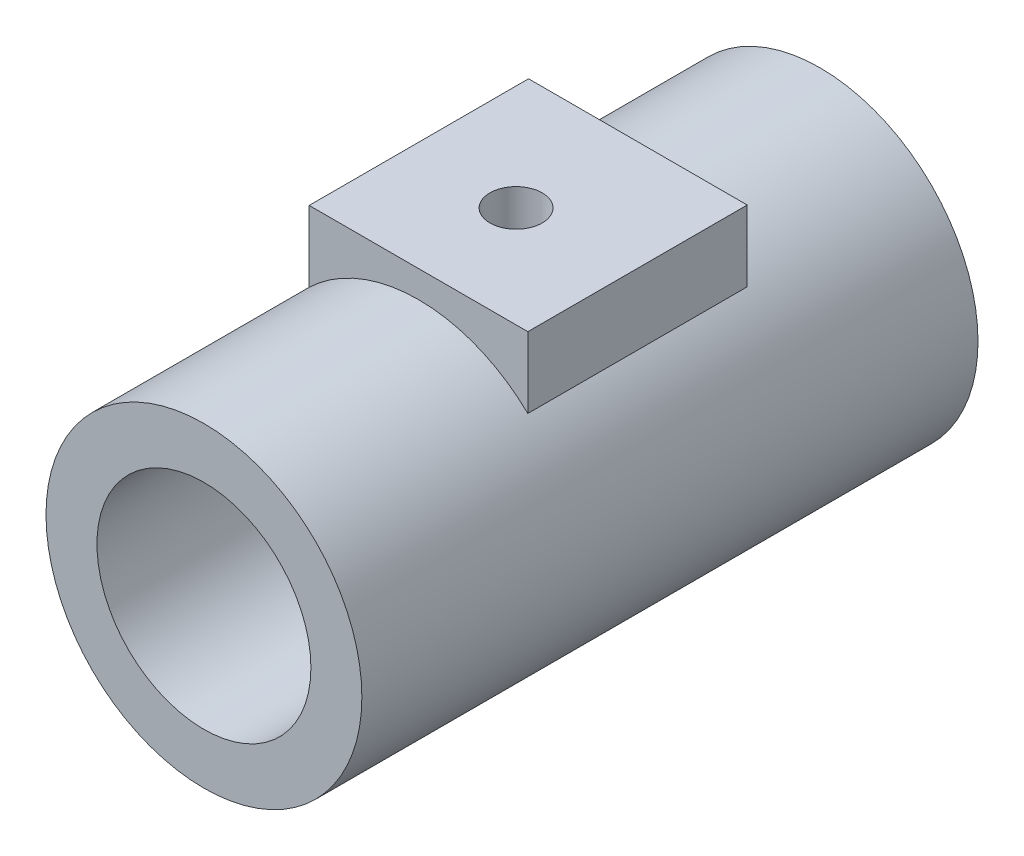
ISO-10303-21;
HEADER;
FILE_DESCRIPTION(('STEP AP214'),'2;1');
FILE_NAME('part.step','',(''),(''),'','','');
FILE_SCHEMA(('AUTOMOTIVE_DESIGN { 1 0 10303 214 1 1 1 1 }'));
ENDSEC;
DATA;
#1=APPLICATION_CONTEXT('core data for automotive mechanical design processes');
#2=APPLICATION_PROTOCOL_DEFINITION('international standard','automotive_design',2000,#1);
#3=PRODUCT_CONTEXT('',#1,'mechanical');
#4=PRODUCT('Part','Part','',(#3));
#5=PRODUCT_RELATED_PRODUCT_CATEGORY('part','',(#4));
#6=PRODUCT_DEFINITION_FORMATION('','',#4);
#7=PRODUCT_DEFINITION_CONTEXT('part definition',#1,'design');
#8=PRODUCT_DEFINITION('design','',#6,#7);
#9=PRODUCT_DEFINITION_SHAPE('','',#8);
#10=(LENGTH_UNIT() NAMED_UNIT(*) SI_UNIT(.MILLI.,.METRE.));
#11=(NAMED_UNIT(*) PLANE_ANGLE_UNIT() SI_UNIT($,.RADIAN.));
#12=(NAMED_UNIT(*) SI_UNIT($,.STERADIAN.) SOLID_ANGLE_UNIT());
#13=UNCERTAINTY_MEASURE_WITH_UNIT(LENGTH_MEASURE(1.E-05),#10,'distance_accuracy_value','');
#14=(GEOMETRIC_REPRESENTATION_CONTEXT(3) GLOBAL_UNCERTAINTY_ASSIGNED_CONTEXT((#13)) GLOBAL_UNIT_ASSIGNED_CONTEXT((#10,
#11,#12)) REPRESENTATION_CONTEXT('',''));
#15=CARTESIAN_POINT('',(0.,0.,0.));
#16=DIRECTION('',(0.,0.,1.));
#17=DIRECTION('',(1.,0.,0.));
#18=AXIS2_PLACEMENT_3D('',#15,#16,#17);
#19=CARTESIAN_POINT('',(0.,45.,71.0551160971746));
#20=DIRECTION('',(0.,-1.,0.));
#21=DIRECTION('',(0.,0.,-1.));
#22=AXIS2_PLACEMENT_3D('',#19,#20,#21);
#23=CYLINDRICAL_SURFACE('',#22,22.4882747443512);
#24=CARTESIAN_POINT('',(0.,-0.99999999999999,71.0551160971746));
#25=DIRECTION('',(0.,1.,0.));
#26=DIRECTION('',(0.,0.,1.));
#27=AXIS2_PLACEMENT_3D('',#24,#25,#26);
#28=CIRCLE('',#27,22.4882747443512);
#29=CARTESIAN_POINT('',(0.,-0.99999999999999,93.5433908415259));
#30=VERTEX_POINT('',#29);
#31=EDGE_CURVE('E112',#30,#30,#28,.T.);
#32=ORIENTED_EDGE('',*,*,#31,.F.);
#33=EDGE_LOOP('',(#32));
#34=FACE_BOUND('',#33,.T.);
#35=CARTESIAN_POINT('',(0.,0.,71.0551160971746));
#36=DIRECTION('',(0.,1.,0.));
#37=DIRECTION('',(0.,0.,1.));
#38=AXIS2_PLACEMENT_3D('',#35,#36,#37);
#39=CIRCLE('',#38,22.4882747443512);
#40=CARTESIAN_POINT('',(0.,0.,93.5433908415259));
#41=VERTEX_POINT('',#40);
#42=EDGE_CURVE('E183',#41,#41,#39,.T.);
#43=ORIENTED_EDGE('',*,*,#42,.T.);
#44=EDGE_LOOP('',(#43));
#45=FACE_BOUND('',#44,.T.);
#46=ADVANCED_FACE('F45',(#34,#45),#23,.F.);
#47=CARTESIAN_POINT('',(0.,0.,0.));
#48=DIRECTION('',(0.,0.,1.));
#49=DIRECTION('',(1.,0.,0.));
#50=AXIS2_PLACEMENT_3D('',#47,#48,#49);
#51=CYLINDRICAL_SURFACE('',#50,26.0462539697621);
#52=CARTESIAN_POINT('',(0.,0.,0.));
#53=DIRECTION('',(0.,0.,1.));
#54=DIRECTION('',(1.,0.,0.));
#55=AXIS2_PLACEMENT_3D('',#52,#53,#54);
#56=CIRCLE('',#55,26.0462539697621);
#57=CARTESIAN_POINT('',(26.0462539697621,0.,0.));
#58=VERTEX_POINT('',#57);
#59=EDGE_CURVE('E154',#58,#58,#56,.T.);
#60=ORIENTED_EDGE('',*,*,#59,.F.);
#61=EDGE_LOOP('',(#60));
#62=FACE_BOUND('',#61,.T.);
#63=CARTESIAN_POINT('',(0.,0.,150.));
#64=DIRECTION('',(0.,0.,1.));
#65=DIRECTION('',(1.,0.,0.));
#66=AXIS2_PLACEMENT_3D('',#63,#64,#65);
#67=CIRCLE('',#66,26.0462539697621);
#68=CARTESIAN_POINT('',(26.0462539697621,0.,150.));
#69=VERTEX_POINT('',#68);
#70=EDGE_CURVE('E158',#69,#69,#67,.T.);
#71=ORIENTED_EDGE('',*,*,#70,.T.);
#72=EDGE_LOOP('',(#71));
#73=FACE_BOUND('',#72,.T.);
#74=DIRECTION('',(0.,0.,1.));
#75=VECTOR('',#74,1.);
#76=CARTESIAN_POINT('',(-26.0270502719257,-0.999999999999992,0.));
#77=LINE('',#76,#75);
#78=CARTESIAN_POINT('',(-26.0270502719257,-0.999999999999992,97.7589455932233));
#79=VERTEX_POINT('',#78);
#80=CARTESIAN_POINT('',(-26.0270502719257,-0.999999999999992,44.3512866011259));
#81=VERTEX_POINT('',#80);
#82=EDGE_CURVE('E71',#79,#81,#77,.F.);
#83=ORIENTED_EDGE('',*,*,#82,.F.);
#84=CARTESIAN_POINT('',(0.,0.,97.7589455932233));
#85=DIRECTION('',(0.,0.,1.));
#86=DIRECTION('',(1.,0.,0.));
#87=AXIS2_PLACEMENT_3D('',#84,#85,#86);
#88=CIRCLE('',#87,26.0462539697621);
#89=CARTESIAN_POINT('',(26.0270502719257,-0.999999999999992,97.7589455932233));
#90=VERTEX_POINT('',#89);
#91=EDGE_CURVE('E177',#79,#90,#88,.F.);
#92=ORIENTED_EDGE('',*,*,#91,.T.);
#93=DIRECTION('',(0.,0.,1.));
#94=VECTOR('',#93,1.);
#95=CARTESIAN_POINT('',(26.0270502719257,-0.999999999999992,0.));
#96=LINE('',#95,#94);
#97=CARTESIAN_POINT('',(26.0270502719257,-0.999999999999992,44.3512866011259));
#98=VERTEX_POINT('',#97);
#99=EDGE_CURVE('E167',#98,#90,#96,.T.);
#100=ORIENTED_EDGE('',*,*,#99,.F.);
#101=CARTESIAN_POINT('',(0.,0.,44.3512866011259));
#102=DIRECTION('',(0.,0.,-1.));
#103=DIRECTION('',(-1.,0.,0.));
#104=AXIS2_PLACEMENT_3D('',#101,#102,#103);
#105=CIRCLE('',#104,26.0462539697621);
#106=EDGE_CURVE('E174',#98,#81,#105,.F.);
#107=ORIENTED_EDGE('',*,*,#106,.T.);
#108=EDGE_LOOP('',(#83,#92,#100,#107));
#109=FACE_BOUND('',#108,.T.);
#110=ADVANCED_FACE('F211',(#62,#73,#109),#51,.F.);
#111=CARTESIAN_POINT('',(0.,0.,150.));
#112=DIRECTION('',(0.,0.,-1.));
#113=DIRECTION('',(-1.,0.,0.));
#114=AXIS2_PLACEMENT_3D('',#111,#112,#113);
#115=CYLINDRICAL_SURFACE('',#114,38.4485204477851);
#116=CARTESIAN_POINT('',(0.,0.,44.3512866011259));
#117=DIRECTION('',(0.,0.,-1.));
#118=DIRECTION('',(-1.,0.,0.));
#119=AXIS2_PLACEMENT_3D('',#116,#117,#118);
#120=CIRCLE('',#119,38.4485204477851);
#121=CARTESIAN_POINT('',(-26.6143728174647,27.7482230810685,44.3512866011259));
#122=VERTEX_POINT('',#121);
#123=CARTESIAN_POINT('',(26.6143728174647,27.7482230810685,44.3512866011259));
#124=VERTEX_POINT('',#123);
#125=EDGE_CURVE('E141',#122,#124,#120,.T.);
#126=ORIENTED_EDGE('',*,*,#125,.T.);
#127=DIRECTION('',(0.,0.,-1.));
#128=VECTOR('',#127,1.);
#129=CARTESIAN_POINT('',(26.6143728174647,27.7482230810685,150.));
#130=LINE('',#129,#128);
#131=CARTESIAN_POINT('',(26.6143728174647,27.7482230810685,97.7589455932233));
#132=VERTEX_POINT('',#131);
#133=EDGE_CURVE('E11',#124,#132,#130,.F.);
#134=ORIENTED_EDGE('',*,*,#133,.T.);
#135=CARTESIAN_POINT('',(0.,0.,97.7589455932233));
#136=DIRECTION('',(0.,0.,1.));
#137=DIRECTION('',(1.,0.,0.));
#138=AXIS2_PLACEMENT_3D('',#135,#136,#137);
#139=CIRCLE('',#138,38.4485204477851);
#140=CARTESIAN_POINT('',(-26.6143728174647,27.7482230810685,97.7589455932233));
#141=VERTEX_POINT('',#140);
#142=EDGE_CURVE('E150',#132,#141,#139,.T.);
#143=ORIENTED_EDGE('',*,*,#142,.T.);
#144=DIRECTION('',(0.,0.,-1.));
#145=VECTOR('',#144,1.);
#146=CARTESIAN_POINT('',(-26.6143728174647,27.7482230810685,150.));
#147=LINE('',#146,#145);
#148=EDGE_CURVE('E55',#141,#122,#147,.T.);
#149=ORIENTED_EDGE('',*,*,#148,.T.);
#150=EDGE_LOOP('',(#126,#134,#143,#149));
#151=FACE_BOUND('',#150,.T.);
#152=CARTESIAN_POINT('',(0.,0.,150.));
#153=DIRECTION('',(0.,0.,1.));
#154=DIRECTION('',(1.,0.,0.));
#155=AXIS2_PLACEMENT_3D('',#152,#153,#154);
#156=CIRCLE('',#155,38.4485204477851);
#157=CARTESIAN_POINT('',(38.4485204477851,0.,150.));
#158=VERTEX_POINT('',#157);
#159=EDGE_CURVE('E163',#158,#158,#156,.T.);
#160=ORIENTED_EDGE('',*,*,#159,.F.);
#161=EDGE_LOOP('',(#160));
#162=FACE_BOUND('',#161,.T.);
#163=CARTESIAN_POINT('',(0.,0.,0.));
#164=DIRECTION('',(0.,0.,1.));
#165=DIRECTION('',(1.,0.,0.));
#166=AXIS2_PLACEMENT_3D('',#163,#164,#165);
#167=CIRCLE('',#166,38.4485204477851);
#168=CARTESIAN_POINT('',(38.4485204477851,0.,0.));
#169=VERTEX_POINT('',#168);
#170=EDGE_CURVE('E162',#169,#169,#167,.T.);
#171=ORIENTED_EDGE('',*,*,#170,.T.);
#172=EDGE_LOOP('',(#171));
#173=FACE_BOUND('',#172,.T.);
#174=ADVANCED_FACE('F47',(#151,#162,#173),#115,.T.);
#175=CARTESIAN_POINT('',(0.,0.,150.));
#176=DIRECTION('',(0.,0.,1.));
#177=DIRECTION('',(1.,0.,0.));
#178=AXIS2_PLACEMENT_3D('',#175,#176,#177);
#179=PLANE('',#178);
#180=ORIENTED_EDGE('',*,*,#70,.F.);
#181=EDGE_LOOP('',(#180));
#182=FACE_BOUND('',#181,.T.);
#183=ORIENTED_EDGE('',*,*,#159,.T.);
#184=EDGE_LOOP('',(#183));
#185=FACE_BOUND('',#184,.T.);
#186=ADVANCED_FACE('F243',(#182,#185),#179,.T.);
#187=CARTESIAN_POINT('',(0.,0.,0.));
#188=DIRECTION('',(0.,0.,1.));
#189=DIRECTION('',(1.,0.,0.));
#190=AXIS2_PLACEMENT_3D('',#187,#188,#189);
#191=PLANE('',#190);
#192=ORIENTED_EDGE('',*,*,#59,.T.);
#193=EDGE_LOOP('',(#192));
#194=FACE_BOUND('',#193,.T.);
#195=ORIENTED_EDGE('',*,*,#170,.F.);
#196=EDGE_LOOP('',(#195));
#197=FACE_BOUND('',#196,.T.);
#198=ADVANCED_FACE('F228',(#194,#197),#191,.F.);
#199=CARTESIAN_POINT('',(0.,-0.999999999999992,0.));
#200=DIRECTION('',(0.,1.,0.));
#201=DIRECTION('',(0.,0.,1.));
#202=AXIS2_PLACEMENT_3D('',#199,#200,#201);
#203=PLANE('',#202);
#204=ORIENTED_EDGE('',*,*,#31,.T.);
#205=EDGE_LOOP('',(#204));
#206=FACE_BOUND('',#205,.T.);
#207=DIRECTION('',(1.,0.,0.));
#208=VECTOR('',#207,1.);
#209=CARTESIAN_POINT('',(-26.6143728174647,-0.999999999999992,97.7589455932233));
#210=LINE('',#209,#208);
#211=EDGE_CURVE('E118',#79,#90,#210,.T.);
#212=ORIENTED_EDGE('',*,*,#211,.F.);
#213=ORIENTED_EDGE('',*,*,#82,.T.);
#214=DIRECTION('',(-1.,0.,0.));
#215=VECTOR('',#214,1.);
#216=CARTESIAN_POINT('',(-26.6143728174647,-0.999999999999992,44.3512866011259));
#217=LINE('',#216,#215);
#218=EDGE_CURVE('E131',#98,#81,#217,.T.);
#219=ORIENTED_EDGE('',*,*,#218,.F.);
#220=ORIENTED_EDGE('',*,*,#99,.T.);
#221=EDGE_LOOP('',(#212,#213,#219,#220));
#222=FACE_BOUND('',#221,.T.);
#223=ADVANCED_FACE('F225',(#206,#222),#203,.F.);
#224=CARTESIAN_POINT('',(-26.6143728174647,-0.999999999999992,44.3512866011259));
#225=DIRECTION('',(0.,0.,-1.));
#226=DIRECTION('',(-1.,0.,0.));
#227=AXIS2_PLACEMENT_3D('',#224,#225,#226);
#228=PLANE('',#227);
#229=ORIENTED_EDGE('',*,*,#106,.F.);
#230=ORIENTED_EDGE('',*,*,#218,.T.);
#231=EDGE_LOOP('',(#229,#230));
#232=FACE_BOUND('',#231,.T.);
#233=ADVANCED_FACE('F227',(#232),#228,.T.);
#234=CARTESIAN_POINT('',(-26.6143728174647,-0.999999999999992,97.7589455932233));
#235=DIRECTION('',(0.,0.,1.));
#236=DIRECTION('',(1.,0.,0.));
#237=AXIS2_PLACEMENT_3D('',#234,#235,#236);
#238=PLANE('',#237);
#239=ORIENTED_EDGE('',*,*,#211,.T.);
#240=ORIENTED_EDGE('',*,*,#91,.F.);
#241=EDGE_LOOP('',(#239,#240));
#242=FACE_BOUND('',#241,.T.);
#243=ADVANCED_FACE('F235',(#242),#238,.T.);
#244=CARTESIAN_POINT('',(26.6143728174647,-0.999999999999992,44.3512866011259));
#245=DIRECTION('',(1.,0.,0.));
#246=DIRECTION('',(0.,0.,-1.));
#247=AXIS2_PLACEMENT_3D('',#244,#245,#246);
#248=PLANE('',#247);
#249=DIRECTION('',(0.,1.,0.));
#250=VECTOR('',#249,1.);
#251=CARTESIAN_POINT('',(26.6143728174647,-0.999999999999992,97.7589455932233));
#252=LINE('',#251,#250);
#253=CARTESIAN_POINT('',(26.6143728174647,45.,97.7589455932233));
#254=VERTEX_POINT('',#253);
#255=EDGE_CURVE('E138',#132,#254,#252,.T.);
#256=ORIENTED_EDGE('',*,*,#255,.F.);
#257=ORIENTED_EDGE('',*,*,#133,.F.);
#258=DIRECTION('',(0.,1.,0.));
#259=VECTOR('',#258,1.);
#260=CARTESIAN_POINT('',(26.6143728174647,-0.999999999999992,44.3512866011259));
#261=LINE('',#260,#259);
#262=CARTESIAN_POINT('',(26.6143728174647,45.,44.3512866011259));
#263=VERTEX_POINT('',#262);
#264=EDGE_CURVE('E63',#124,#263,#261,.T.);
#265=ORIENTED_EDGE('',*,*,#264,.T.);
#266=DIRECTION('',(0.,0.,-1.));
#267=VECTOR('',#266,1.);
#268=CARTESIAN_POINT('',(26.6143728174647,45.,44.3512866011259));
#269=LINE('',#268,#267);
#270=EDGE_CURVE('E103',#254,#263,#269,.T.);
#271=ORIENTED_EDGE('',*,*,#270,.F.);
#272=EDGE_LOOP('',(#256,#257,#265,#271));
#273=FACE_BOUND('',#272,.T.);
#274=ADVANCED_FACE('F114',(#273),#248,.T.);
#275=CARTESIAN_POINT('',(-26.6143728174647,-0.999999999999992,44.3512866011259));
#276=DIRECTION('',(-1.,0.,0.));
#277=DIRECTION('',(0.,0.,1.));
#278=AXIS2_PLACEMENT_3D('',#275,#276,#277);
#279=PLANE('',#278);
#280=DIRECTION('',(0.,1.,0.));
#281=VECTOR('',#280,1.);
#282=CARTESIAN_POINT('',(-26.6143728174647,-0.999999999999992,97.7589455932233));
#283=LINE('',#282,#281);
#284=CARTESIAN_POINT('',(-26.6143728174647,45.,97.7589455932233));
#285=VERTEX_POINT('',#284);
#286=EDGE_CURVE('E142',#141,#285,#283,.T.);
#287=ORIENTED_EDGE('',*,*,#286,.T.);
#288=DIRECTION('',(0.,0.,1.));
#289=VECTOR('',#288,1.);
#290=CARTESIAN_POINT('',(-26.6143728174647,45.,44.3512866011259));
#291=LINE('',#290,#289);
#292=CARTESIAN_POINT('',(-26.6143728174647,45.,44.3512866011259));
#293=VERTEX_POINT('',#292);
#294=EDGE_CURVE('E123',#293,#285,#291,.T.);
#295=ORIENTED_EDGE('',*,*,#294,.F.);
#296=DIRECTION('',(0.,1.,0.));
#297=VECTOR('',#296,1.);
#298=CARTESIAN_POINT('',(-26.6143728174647,-0.999999999999992,44.3512866011259));
#299=LINE('',#298,#297);
#300=EDGE_CURVE('E117',#122,#293,#299,.T.);
#301=ORIENTED_EDGE('',*,*,#300,.F.);
#302=ORIENTED_EDGE('',*,*,#148,.F.);
#303=EDGE_LOOP('',(#287,#295,#301,#302));
#304=FACE_BOUND('',#303,.T.);
#305=ADVANCED_FACE('F233',(#304),#279,.T.);
#306=ORIENTED_EDGE('',*,*,#142,.F.);
#307=ORIENTED_EDGE('',*,*,#255,.T.);
#308=DIRECTION('',(1.,0.,0.));
#309=VECTOR('',#308,1.);
#310=CARTESIAN_POINT('',(-26.6143728174647,45.,97.7589455932233));
#311=LINE('',#310,#309);
#312=EDGE_CURVE('E108',#285,#254,#311,.T.);
#313=ORIENTED_EDGE('',*,*,#312,.F.);
#314=ORIENTED_EDGE('',*,*,#286,.F.);
#315=EDGE_LOOP('',(#306,#307,#313,#314));
#316=FACE_BOUND('',#315,.T.);
#317=ADVANCED_FACE('F230',(#316),#238,.T.);
#318=ORIENTED_EDGE('',*,*,#125,.F.);
#319=ORIENTED_EDGE('',*,*,#300,.T.);
#320=DIRECTION('',(-1.,0.,0.));
#321=VECTOR('',#320,1.);
#322=CARTESIAN_POINT('',(-26.6143728174647,45.,44.3512866011259));
#323=LINE('',#322,#321);
#324=EDGE_CURVE('E105',#263,#293,#323,.T.);
#325=ORIENTED_EDGE('',*,*,#324,.F.);
#326=ORIENTED_EDGE('',*,*,#264,.F.);
#327=EDGE_LOOP('',(#318,#319,#325,#326));
#328=FACE_BOUND('',#327,.T.);
#329=ADVANCED_FACE('F120',(#328),#228,.T.);
#330=CARTESIAN_POINT('',(0.,45.,0.));
#331=DIRECTION('',(0.,1.,0.));
#332=DIRECTION('',(0.,0.,1.));
#333=AXIS2_PLACEMENT_3D('',#330,#331,#332);
#334=PLANE('',#333);
#335=CARTESIAN_POINT('',(-0.905733707838863,45.,73.1050801430797));
#336=DIRECTION('',(0.,1.,0.));
#337=DIRECTION('',(0.,0.,1.));
#338=AXIS2_PLACEMENT_3D('',#335,#336,#337);
#339=CIRCLE('',#338,6.36411817545153);
#340=CARTESIAN_POINT('',(-0.905733707838863,45.,79.4691983185312));
#341=VERTEX_POINT('',#340);
#342=EDGE_CURVE('E186',#341,#341,#339,.T.);
#343=ORIENTED_EDGE('',*,*,#342,.F.);
#344=EDGE_LOOP('',(#343));
#345=FACE_BOUND('',#344,.T.);
#346=ORIENTED_EDGE('',*,*,#270,.T.);
#347=ORIENTED_EDGE('',*,*,#324,.T.);
#348=ORIENTED_EDGE('',*,*,#294,.T.);
#349=ORIENTED_EDGE('',*,*,#312,.T.);
#350=EDGE_LOOP('',(#346,#347,#348,#349));
#351=FACE_BOUND('',#350,.T.);
#352=ADVANCED_FACE('F104',(#345,#351),#334,.T.);
#353=CARTESIAN_POINT('',(0.,0.,0.));
#354=DIRECTION('',(0.,1.,0.));
#355=DIRECTION('',(0.,0.,1.));
#356=AXIS2_PLACEMENT_3D('',#353,#354,#355);
#357=PLANE('',#356);
#358=CARTESIAN_POINT('',(-0.905733707838863,0.,73.1050801430797));
#359=DIRECTION('',(0.,1.,0.));
#360=DIRECTION('',(0.,0.,1.));
#361=AXIS2_PLACEMENT_3D('',#358,#359,#360);
#362=CIRCLE('',#361,6.36411817545153);
#363=CARTESIAN_POINT('',(-0.905733707838863,0.,79.4691983185312));
#364=VERTEX_POINT('',#363);
#365=EDGE_CURVE('E49',#364,#364,#362,.T.);
#366=ORIENTED_EDGE('',*,*,#365,.T.);
#367=EDGE_LOOP('',(#366));
#368=FACE_BOUND('',#367,.T.);
#369=ORIENTED_EDGE('',*,*,#42,.F.);
#370=EDGE_LOOP('',(#369));
#371=FACE_BOUND('',#370,.T.);
#372=ADVANCED_FACE('F200',(#368,#371),#357,.F.);
#373=CARTESIAN_POINT('',(-0.905733707838863,-1.,73.1050801430797));
#374=DIRECTION('',(0.,1.,0.));
#375=DIRECTION('',(0.,0.,1.));
#376=AXIS2_PLACEMENT_3D('',#373,#374,#375);
#377=CYLINDRICAL_SURFACE('',#376,6.36411817545153);
#378=ORIENTED_EDGE('',*,*,#342,.T.);
#379=EDGE_LOOP('',(#378));
#380=FACE_BOUND('',#379,.T.);
#381=ORIENTED_EDGE('',*,*,#365,.F.);
#382=EDGE_LOOP('',(#381));
#383=FACE_BOUND('',#382,.T.);
#384=ADVANCED_FACE('F203',(#380,#383),#377,.F.);
#385=CLOSED_SHELL('',(#46,#110,#174,#186,#198,#223,#233,#243,#274,#305,#317,#329,#352,#372,#384));
#386=MANIFOLD_SOLID_BREP('B2',#385);
#387=ADVANCED_BREP_SHAPE_REPRESENTATION('',(#18,#386),#14);
#388=SHAPE_DEFINITION_REPRESENTATION(#9,#387);
ENDSEC;
END-ISO-10303-21;
